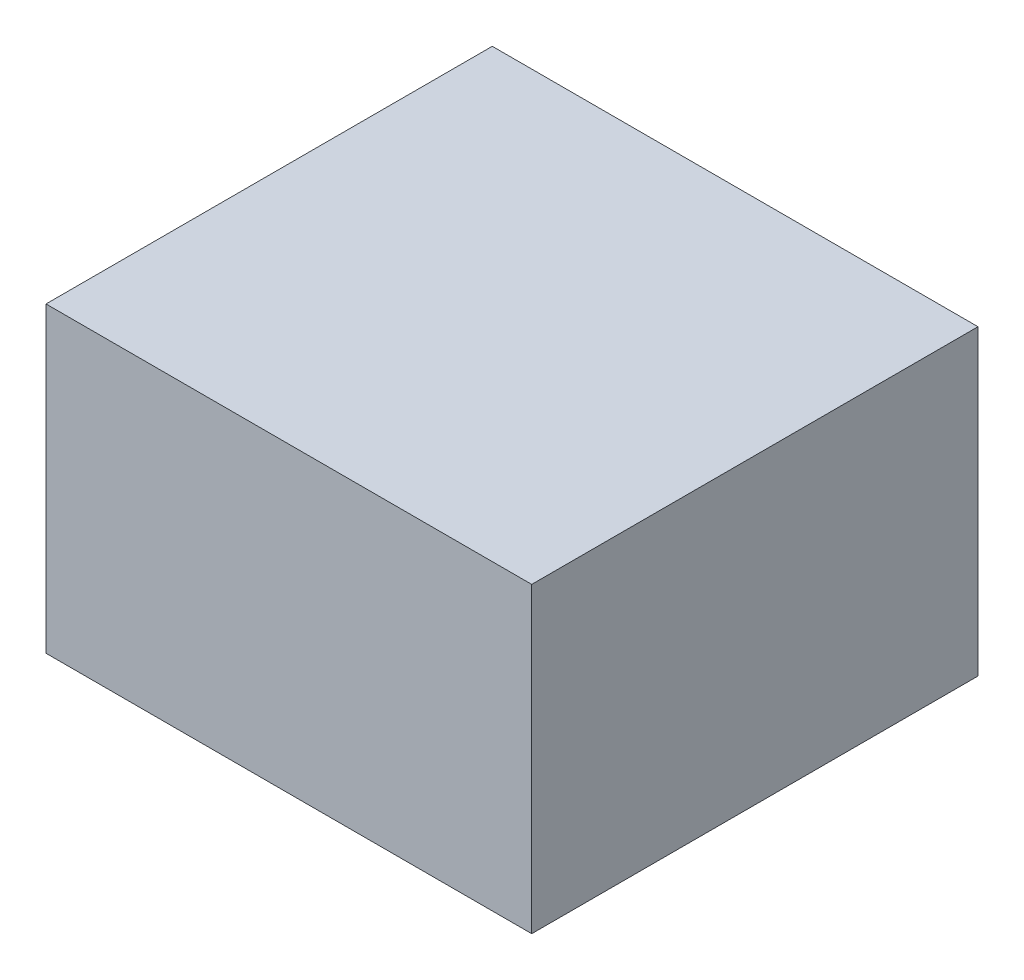
ISO-10303-21;
HEADER;
FILE_DESCRIPTION(('STEP AP214'),'2;1');
FILE_NAME('part.step','',(''),(''),'','','');
FILE_SCHEMA(('AUTOMOTIVE_DESIGN { 1 0 10303 214 1 1 1 1 }'));
ENDSEC;
DATA;
#1=APPLICATION_CONTEXT('core data for automotive mechanical design processes');
#2=APPLICATION_PROTOCOL_DEFINITION('international standard','automotive_design',2000,#1);
#3=PRODUCT_CONTEXT('',#1,'mechanical');
#4=PRODUCT('Part','Part','',(#3));
#5=PRODUCT_RELATED_PRODUCT_CATEGORY('part','',(#4));
#6=PRODUCT_DEFINITION_FORMATION('','',#4);
#7=PRODUCT_DEFINITION_CONTEXT('part definition',#1,'design');
#8=PRODUCT_DEFINITION('design','',#6,#7);
#9=PRODUCT_DEFINITION_SHAPE('','',#8);
#10=(LENGTH_UNIT() NAMED_UNIT(*) SI_UNIT(.MILLI.,.METRE.));
#11=(NAMED_UNIT(*) PLANE_ANGLE_UNIT() SI_UNIT($,.RADIAN.));
#12=(NAMED_UNIT(*) SI_UNIT($,.STERADIAN.) SOLID_ANGLE_UNIT());
#13=UNCERTAINTY_MEASURE_WITH_UNIT(LENGTH_MEASURE(1.E-05),#10,'distance_accuracy_value','');
#14=(GEOMETRIC_REPRESENTATION_CONTEXT(3) GLOBAL_UNCERTAINTY_ASSIGNED_CONTEXT((#13)) GLOBAL_UNIT_ASSIGNED_CONTEXT((#10,
#11,#12)) REPRESENTATION_CONTEXT('',''));
#15=CARTESIAN_POINT('',(0.,0.,0.));
#16=DIRECTION('',(0.,0.,1.));
#17=DIRECTION('',(1.,0.,0.));
#18=AXIS2_PLACEMENT_3D('',#15,#16,#17);
#19=CARTESIAN_POINT('',(0.,291.5,0.));
#20=DIRECTION('',(1.,0.,0.));
#21=DIRECTION('',(0.,0.,-1.));
#22=AXIS2_PLACEMENT_3D('',#19,#20,#21);
#23=PLANE('',#22);
#24=DIRECTION('',(0.,0.,1.));
#25=VECTOR('',#24,1.);
#26=CARTESIAN_POINT('',(0.,0.,0.));
#27=LINE('',#26,#25);
#28=CARTESIAN_POINT('',(0.,0.,-430.));
#29=VERTEX_POINT('',#28);
#30=CARTESIAN_POINT('',(0.,0.,0.));
#31=VERTEX_POINT('',#30);
#32=EDGE_CURVE('E99',#29,#31,#27,.T.);
#33=ORIENTED_EDGE('',*,*,#32,.T.);
#34=DIRECTION('',(0.,-1.,0.));
#35=VECTOR('',#34,1.);
#36=CARTESIAN_POINT('',(0.,291.5,0.));
#37=LINE('',#36,#35);
#38=CARTESIAN_POINT('',(0.,291.5,0.));
#39=VERTEX_POINT('',#38);
#40=EDGE_CURVE('E11',#39,#31,#37,.T.);
#41=ORIENTED_EDGE('',*,*,#40,.F.);
#42=DIRECTION('',(0.,0.,1.));
#43=VECTOR('',#42,1.);
#44=CARTESIAN_POINT('',(0.,291.5,0.));
#45=LINE('',#44,#43);
#46=CARTESIAN_POINT('',(0.,291.5,-430.));
#47=VERTEX_POINT('',#46);
#48=EDGE_CURVE('E87',#47,#39,#45,.T.);
#49=ORIENTED_EDGE('',*,*,#48,.F.);
#50=DIRECTION('',(0.,-1.,0.));
#51=VECTOR('',#50,1.);
#52=CARTESIAN_POINT('',(0.,291.5,-430.));
#53=LINE('',#52,#51);
#54=EDGE_CURVE('E95',#47,#29,#53,.T.);
#55=ORIENTED_EDGE('',*,*,#54,.T.);
#56=EDGE_LOOP('',(#33,#41,#49,#55));
#57=FACE_BOUND('',#56,.T.);
#58=ADVANCED_FACE('F36',(#57),#23,.F.);
#59=CARTESIAN_POINT('',(0.,291.5,0.));
#60=DIRECTION('',(0.,0.,-1.));
#61=DIRECTION('',(-1.,0.,0.));
#62=AXIS2_PLACEMENT_3D('',#59,#60,#61);
#63=PLANE('',#62);
#64=DIRECTION('',(1.,0.,0.));
#65=VECTOR('',#64,1.);
#66=CARTESIAN_POINT('',(0.,0.,0.));
#67=LINE('',#66,#65);
#68=CARTESIAN_POINT('',(468.,0.,0.));
#69=VERTEX_POINT('',#68);
#70=EDGE_CURVE('E91',#31,#69,#67,.T.);
#71=ORIENTED_EDGE('',*,*,#70,.T.);
#72=DIRECTION('',(0.,-1.,0.));
#73=VECTOR('',#72,1.);
#74=CARTESIAN_POINT('',(468.,291.5,0.));
#75=LINE('',#74,#73);
#76=CARTESIAN_POINT('',(468.,291.5,0.));
#77=VERTEX_POINT('',#76);
#78=EDGE_CURVE('E44',#77,#69,#75,.T.);
#79=ORIENTED_EDGE('',*,*,#78,.F.);
#80=DIRECTION('',(1.,0.,0.));
#81=VECTOR('',#80,1.);
#82=CARTESIAN_POINT('',(0.,291.5,0.));
#83=LINE('',#82,#81);
#84=EDGE_CURVE('E82',#39,#77,#83,.T.);
#85=ORIENTED_EDGE('',*,*,#84,.F.);
#86=ORIENTED_EDGE('',*,*,#40,.T.);
#87=EDGE_LOOP('',(#71,#79,#85,#86));
#88=FACE_BOUND('',#87,.T.);
#89=ADVANCED_FACE('F90',(#88),#63,.F.);
#90=CARTESIAN_POINT('',(468.,291.5,0.));
#91=DIRECTION('',(-1.,0.,0.));
#92=DIRECTION('',(0.,0.,1.));
#93=AXIS2_PLACEMENT_3D('',#90,#91,#92);
#94=PLANE('',#93);
#95=DIRECTION('',(0.,0.,-1.));
#96=VECTOR('',#95,1.);
#97=CARTESIAN_POINT('',(468.,0.,0.));
#98=LINE('',#97,#96);
#99=CARTESIAN_POINT('',(468.,0.,-430.));
#100=VERTEX_POINT('',#99);
#101=EDGE_CURVE('E69',#69,#100,#98,.T.);
#102=ORIENTED_EDGE('',*,*,#101,.T.);
#103=DIRECTION('',(0.,-1.,0.));
#104=VECTOR('',#103,1.);
#105=CARTESIAN_POINT('',(468.,291.5,-430.));
#106=LINE('',#105,#104);
#107=CARTESIAN_POINT('',(468.,291.5,-430.));
#108=VERTEX_POINT('',#107);
#109=EDGE_CURVE('E92',#108,#100,#106,.T.);
#110=ORIENTED_EDGE('',*,*,#109,.F.);
#111=DIRECTION('',(0.,0.,-1.));
#112=VECTOR('',#111,1.);
#113=CARTESIAN_POINT('',(468.,291.5,0.));
#114=LINE('',#113,#112);
#115=EDGE_CURVE('E85',#77,#108,#114,.T.);
#116=ORIENTED_EDGE('',*,*,#115,.F.);
#117=ORIENTED_EDGE('',*,*,#78,.T.);
#118=EDGE_LOOP('',(#102,#110,#116,#117));
#119=FACE_BOUND('',#118,.T.);
#120=ADVANCED_FACE('F93',(#119),#94,.F.);
#121=CARTESIAN_POINT('',(0.,291.5,-430.));
#122=DIRECTION('',(0.,0.,1.));
#123=DIRECTION('',(1.,0.,0.));
#124=AXIS2_PLACEMENT_3D('',#121,#122,#123);
#125=PLANE('',#124);
#126=DIRECTION('',(-1.,0.,0.));
#127=VECTOR('',#126,1.);
#128=CARTESIAN_POINT('',(0.,0.,-430.));
#129=LINE('',#128,#127);
#130=EDGE_CURVE('E75',#100,#29,#129,.T.);
#131=ORIENTED_EDGE('',*,*,#130,.T.);
#132=ORIENTED_EDGE('',*,*,#54,.F.);
#133=DIRECTION('',(-1.,0.,0.));
#134=VECTOR('',#133,1.);
#135=CARTESIAN_POINT('',(0.,291.5,-430.));
#136=LINE('',#135,#134);
#137=EDGE_CURVE('E52',#108,#47,#136,.T.);
#138=ORIENTED_EDGE('',*,*,#137,.F.);
#139=ORIENTED_EDGE('',*,*,#109,.T.);
#140=EDGE_LOOP('',(#131,#132,#138,#139));
#141=FACE_BOUND('',#140,.T.);
#142=ADVANCED_FACE('F106',(#141),#125,.F.);
#143=CARTESIAN_POINT('',(0.,291.5,0.));
#144=DIRECTION('',(0.,-1.,0.));
#145=DIRECTION('',(0.,0.,-1.));
#146=AXIS2_PLACEMENT_3D('',#143,#144,#145);
#147=PLANE('',#146);
#148=ORIENTED_EDGE('',*,*,#48,.T.);
#149=ORIENTED_EDGE('',*,*,#84,.T.);
#150=ORIENTED_EDGE('',*,*,#115,.T.);
#151=ORIENTED_EDGE('',*,*,#137,.T.);
#152=EDGE_LOOP('',(#148,#149,#150,#151));
#153=FACE_BOUND('',#152,.T.);
#154=ADVANCED_FACE('F83',(#153),#147,.F.);
#155=CARTESIAN_POINT('',(0.,0.,0.));
#156=DIRECTION('',(0.,-1.,0.));
#157=DIRECTION('',(0.,0.,-1.));
#158=AXIS2_PLACEMENT_3D('',#155,#156,#157);
#159=PLANE('',#158);
#160=ORIENTED_EDGE('',*,*,#32,.F.);
#161=ORIENTED_EDGE('',*,*,#130,.F.);
#162=ORIENTED_EDGE('',*,*,#101,.F.);
#163=ORIENTED_EDGE('',*,*,#70,.F.);
#164=EDGE_LOOP('',(#160,#161,#162,#163));
#165=FACE_BOUND('',#164,.T.);
#166=ADVANCED_FACE('F109',(#165),#159,.T.);
#167=CLOSED_SHELL('',(#58,#89,#120,#142,#154,#166));
#168=MANIFOLD_SOLID_BREP('B2',#167);
#169=ADVANCED_BREP_SHAPE_REPRESENTATION('',(#18,#168),#14);
#170=SHAPE_DEFINITION_REPRESENTATION(#9,#169);
ENDSEC;
END-ISO-10303-21;
